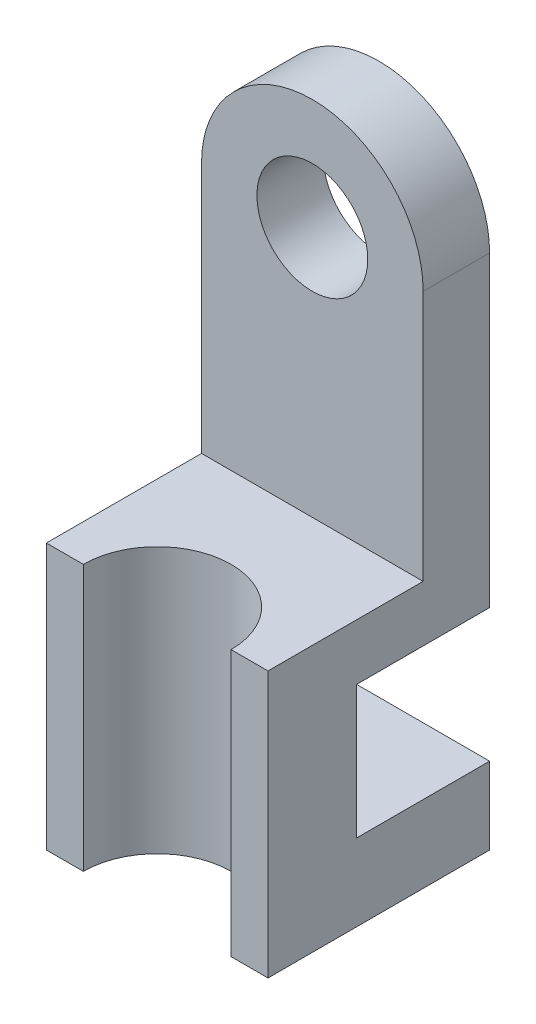
ISO-10303-21;
HEADER;
FILE_DESCRIPTION(('STEP AP214'),'2;1');
FILE_NAME('part.step','',(''),(''),'','','');
FILE_SCHEMA(('AUTOMOTIVE_DESIGN { 1 0 10303 214 1 1 1 1 }'));
ENDSEC;
DATA;
#1=APPLICATION_CONTEXT('core data for automotive mechanical design processes');
#2=APPLICATION_PROTOCOL_DEFINITION('international standard','automotive_design',2000,#1);
#3=PRODUCT_CONTEXT('',#1,'mechanical');
#4=PRODUCT('Part','Part','',(#3));
#5=PRODUCT_RELATED_PRODUCT_CATEGORY('part','',(#4));
#6=PRODUCT_DEFINITION_FORMATION('','',#4);
#7=PRODUCT_DEFINITION_CONTEXT('part definition',#1,'design');
#8=PRODUCT_DEFINITION('design','',#6,#7);
#9=PRODUCT_DEFINITION_SHAPE('','',#8);
#10=(LENGTH_UNIT() NAMED_UNIT(*) SI_UNIT(.MILLI.,.METRE.));
#11=(NAMED_UNIT(*) PLANE_ANGLE_UNIT() SI_UNIT($,.RADIAN.));
#12=(NAMED_UNIT(*) SI_UNIT($,.STERADIAN.) SOLID_ANGLE_UNIT());
#13=UNCERTAINTY_MEASURE_WITH_UNIT(LENGTH_MEASURE(1.E-05),#10,'distance_accuracy_value','');
#14=(GEOMETRIC_REPRESENTATION_CONTEXT(3) GLOBAL_UNCERTAINTY_ASSIGNED_CONTEXT((#13)) GLOBAL_UNIT_ASSIGNED_CONTEXT((#10,
#11,#12)) REPRESENTATION_CONTEXT('',''));
#15=CARTESIAN_POINT('',(0.,0.,0.));
#16=DIRECTION('',(0.,0.,1.));
#17=DIRECTION('',(1.,0.,0.));
#18=AXIS2_PLACEMENT_3D('',#15,#16,#17);
#19=CARTESIAN_POINT('',(0.,70.,-15.));
#20=DIRECTION('',(0.,0.,-1.));
#21=DIRECTION('',(-1.,0.,0.));
#22=AXIS2_PLACEMENT_3D('',#19,#20,#21);
#23=CYLINDRICAL_SURFACE('',#22,15.);
#24=DIRECTION('',(0.,0.,1.));
#25=VECTOR('',#24,1.);
#26=CARTESIAN_POINT('',(15.,70.,-15.));
#27=LINE('',#26,#25);
#28=CARTESIAN_POINT('',(15.,70.,-15.));
#29=VERTEX_POINT('',#28);
#30=CARTESIAN_POINT('',(15.,70.,-6.));
#31=VERTEX_POINT('',#30);
#32=EDGE_CURVE('E127',#29,#31,#27,.T.);
#33=ORIENTED_EDGE('',*,*,#32,.F.);
#34=CARTESIAN_POINT('',(0.,70.,-15.));
#35=DIRECTION('',(0.,0.,1.));
#36=DIRECTION('',(1.,0.,0.));
#37=AXIS2_PLACEMENT_3D('',#34,#35,#36);
#38=CIRCLE('',#37,15.);
#39=CARTESIAN_POINT('',(-15.,70.,-15.));
#40=VERTEX_POINT('',#39);
#41=EDGE_CURVE('E43',#40,#29,#38,.F.);
#42=ORIENTED_EDGE('',*,*,#41,.F.);
#43=DIRECTION('',(0.,0.,1.));
#44=VECTOR('',#43,1.);
#45=CARTESIAN_POINT('',(-15.,70.,-15.));
#46=LINE('',#45,#44);
#47=CARTESIAN_POINT('',(-15.,70.,-6.));
#48=VERTEX_POINT('',#47);
#49=EDGE_CURVE('E218',#48,#40,#46,.F.);
#50=ORIENTED_EDGE('',*,*,#49,.F.);
#51=CARTESIAN_POINT('',(0.,70.,-6.));
#52=DIRECTION('',(0.,0.,-1.));
#53=DIRECTION('',(-1.,0.,0.));
#54=AXIS2_PLACEMENT_3D('',#51,#52,#53);
#55=CIRCLE('',#54,15.);
#56=EDGE_CURVE('E11',#31,#48,#55,.F.);
#57=ORIENTED_EDGE('',*,*,#56,.F.);
#58=EDGE_LOOP('',(#33,#42,#50,#57));
#59=FACE_BOUND('',#58,.T.);
#60=ADVANCED_FACE('F35',(#59),#23,.T.);
#61=CARTESIAN_POINT('',(-15.,36.,15.));
#62=DIRECTION('',(0.,0.,-1.));
#63=DIRECTION('',(-1.,0.,0.));
#64=AXIS2_PLACEMENT_3D('',#61,#62,#63);
#65=PLANE('',#64);
#66=DIRECTION('',(1.,0.,0.));
#67=VECTOR('',#66,1.);
#68=CARTESIAN_POINT('',(-15.,0.,15.));
#69=LINE('',#68,#67);
#70=CARTESIAN_POINT('',(-15.,0.,15.));
#71=VERTEX_POINT('',#70);
#72=CARTESIAN_POINT('',(-10.,0.,15.));
#73=VERTEX_POINT('',#72);
#74=EDGE_CURVE('E141',#71,#73,#69,.T.);
#75=ORIENTED_EDGE('',*,*,#74,.T.);
#76=DIRECTION('',(0.,1.,0.));
#77=VECTOR('',#76,1.);
#78=CARTESIAN_POINT('',(-10.,0.,15.));
#79=LINE('',#78,#77);
#80=CARTESIAN_POINT('',(-10.,36.,15.));
#81=VERTEX_POINT('',#80);
#82=EDGE_CURVE('E161',#73,#81,#79,.T.);
#83=ORIENTED_EDGE('',*,*,#82,.T.);
#84=DIRECTION('',(1.,0.,0.));
#85=VECTOR('',#84,1.);
#86=CARTESIAN_POINT('',(-15.,36.,15.));
#87=LINE('',#86,#85);
#88=CARTESIAN_POINT('',(-15.,36.,15.));
#89=VERTEX_POINT('',#88);
#90=EDGE_CURVE('E193',#89,#81,#87,.T.);
#91=ORIENTED_EDGE('',*,*,#90,.F.);
#92=DIRECTION('',(0.,-1.,0.));
#93=VECTOR('',#92,1.);
#94=CARTESIAN_POINT('',(-15.,36.,15.));
#95=LINE('',#94,#93);
#96=EDGE_CURVE('E208',#89,#71,#95,.T.);
#97=ORIENTED_EDGE('',*,*,#96,.T.);
#98=EDGE_LOOP('',(#75,#83,#91,#97));
#99=FACE_BOUND('',#98,.T.);
#100=ADVANCED_FACE('F235',(#99),#65,.F.);
#101=CARTESIAN_POINT('',(-15.,36.,-15.));
#102=DIRECTION('',(0.,0.,1.));
#103=DIRECTION('',(1.,0.,0.));
#104=AXIS2_PLACEMENT_3D('',#101,#102,#103);
#105=PLANE('',#104);
#106=DIRECTION('',(0.,-1.,0.));
#107=VECTOR('',#106,1.);
#108=CARTESIAN_POINT('',(-15.,36.,-15.));
#109=LINE('',#108,#107);
#110=CARTESIAN_POINT('',(-15.,10.4224192507205,-15.));
#111=VERTEX_POINT('',#110);
#112=CARTESIAN_POINT('',(-15.,0.,-15.));
#113=VERTEX_POINT('',#112);
#114=EDGE_CURVE('E211',#111,#113,#109,.T.);
#115=ORIENTED_EDGE('',*,*,#114,.F.);
#116=DIRECTION('',(1.,0.,0.));
#117=VECTOR('',#116,1.);
#118=CARTESIAN_POINT('',(-15.,10.4224192507205,-15.));
#119=LINE('',#118,#117);
#120=CARTESIAN_POINT('',(15.,10.4224192507205,-15.));
#121=VERTEX_POINT('',#120);
#122=EDGE_CURVE('E182',#111,#121,#119,.T.);
#123=ORIENTED_EDGE('',*,*,#122,.T.);
#124=DIRECTION('',(0.,-1.,0.));
#125=VECTOR('',#124,1.);
#126=CARTESIAN_POINT('',(15.,36.,-15.));
#127=LINE('',#126,#125);
#128=CARTESIAN_POINT('',(15.,0.,-15.));
#129=VERTEX_POINT('',#128);
#130=EDGE_CURVE('E214',#121,#129,#127,.T.);
#131=ORIENTED_EDGE('',*,*,#130,.T.);
#132=DIRECTION('',(-1.,0.,0.));
#133=VECTOR('',#132,1.);
#134=CARTESIAN_POINT('',(-15.,0.,-15.));
#135=LINE('',#134,#133);
#136=EDGE_CURVE('E199',#129,#113,#135,.T.);
#137=ORIENTED_EDGE('',*,*,#136,.T.);
#138=EDGE_LOOP('',(#115,#123,#131,#137));
#139=FACE_BOUND('',#138,.T.);
#140=ADVANCED_FACE('F250',(#139),#105,.F.);
#141=CARTESIAN_POINT('',(15.,36.,-15.));
#142=DIRECTION('',(-1.,0.,0.));
#143=DIRECTION('',(0.,0.,1.));
#144=AXIS2_PLACEMENT_3D('',#141,#142,#143);
#145=PLANE('',#144);
#146=CARTESIAN_POINT('',(15.,28.4224192507205,-15.));
#147=VERTEX_POINT('',#146);
#148=EDGE_CURVE('E215',#29,#147,#127,.T.);
#149=ORIENTED_EDGE('',*,*,#148,.F.);
#150=ORIENTED_EDGE('',*,*,#32,.T.);
#151=DIRECTION('',(0.,-1.,0.));
#152=VECTOR('',#151,1.);
#153=CARTESIAN_POINT('',(15.,85.,-6.));
#154=LINE('',#153,#152);
#155=CARTESIAN_POINT('',(15.,36.,-6.));
#156=VERTEX_POINT('',#155);
#157=EDGE_CURVE('E121',#31,#156,#154,.T.);
#158=ORIENTED_EDGE('',*,*,#157,.T.);
#159=DIRECTION('',(0.,0.,-1.));
#160=VECTOR('',#159,1.);
#161=CARTESIAN_POINT('',(15.,36.,-15.));
#162=LINE('',#161,#160);
#163=CARTESIAN_POINT('',(15.,36.,15.));
#164=VERTEX_POINT('',#163);
#165=EDGE_CURVE('E126',#164,#156,#162,.T.);
#166=ORIENTED_EDGE('',*,*,#165,.F.);
#167=DIRECTION('',(0.,-1.,0.));
#168=VECTOR('',#167,1.);
#169=CARTESIAN_POINT('',(15.,36.,15.));
#170=LINE('',#169,#168);
#171=CARTESIAN_POINT('',(15.,0.,15.));
#172=VERTEX_POINT('',#171);
#173=EDGE_CURVE('E196',#164,#172,#170,.T.);
#174=ORIENTED_EDGE('',*,*,#173,.T.);
#175=DIRECTION('',(0.,0.,-1.));
#176=VECTOR('',#175,1.);
#177=CARTESIAN_POINT('',(15.,0.,-15.));
#178=LINE('',#177,#176);
#179=EDGE_CURVE('E185',#172,#129,#178,.T.);
#180=ORIENTED_EDGE('',*,*,#179,.T.);
#181=ORIENTED_EDGE('',*,*,#130,.F.);
#182=DIRECTION('',(0.,0.,-1.));
#183=VECTOR('',#182,1.);
#184=CARTESIAN_POINT('',(15.,10.4224192507205,-15.));
#185=LINE('',#184,#183);
#186=CARTESIAN_POINT('',(15.,10.4224192507205,3.));
#187=VERTEX_POINT('',#186);
#188=EDGE_CURVE('E169',#187,#121,#185,.T.);
#189=ORIENTED_EDGE('',*,*,#188,.F.);
#190=DIRECTION('',(0.,-1.,0.));
#191=VECTOR('',#190,1.);
#192=CARTESIAN_POINT('',(15.,28.4224192507205,3.));
#193=LINE('',#192,#191);
#194=CARTESIAN_POINT('',(15.,28.4224192507205,3.));
#195=VERTEX_POINT('',#194);
#196=EDGE_CURVE('E178',#195,#187,#193,.T.);
#197=ORIENTED_EDGE('',*,*,#196,.F.);
#198=DIRECTION('',(0.,0.,1.));
#199=VECTOR('',#198,1.);
#200=CARTESIAN_POINT('',(15.,28.4224192507205,-15.));
#201=LINE('',#200,#199);
#202=EDGE_CURVE('E164',#147,#195,#201,.T.);
#203=ORIENTED_EDGE('',*,*,#202,.F.);
#204=EDGE_LOOP('',(#149,#150,#158,#166,#174,#180,#181,#189,#197,#203));
#205=FACE_BOUND('',#204,.T.);
#206=ADVANCED_FACE('F124',(#205),#145,.F.);
#207=CARTESIAN_POINT('',(0.,70.,-15.));
#208=DIRECTION('',(0.,0.,1.));
#209=DIRECTION('',(1.,0.,0.));
#210=AXIS2_PLACEMENT_3D('',#207,#208,#209);
#211=CIRCLE('',#210,7.5);
#212=CARTESIAN_POINT('',(7.5,70.,-15.));
#213=VERTEX_POINT('',#212);
#214=EDGE_CURVE('E145',#213,#213,#211,.T.);
#215=ORIENTED_EDGE('',*,*,#214,.T.);
#216=EDGE_LOOP('',(#215));
#217=FACE_BOUND('',#216,.T.);
#218=CARTESIAN_POINT('',(-15.,28.4224192507205,-15.));
#219=VERTEX_POINT('',#218);
#220=EDGE_CURVE('E212',#40,#219,#109,.T.);
#221=ORIENTED_EDGE('',*,*,#220,.F.);
#222=ORIENTED_EDGE('',*,*,#41,.T.);
#223=ORIENTED_EDGE('',*,*,#148,.T.);
#224=DIRECTION('',(1.,0.,0.));
#225=VECTOR('',#224,1.);
#226=CARTESIAN_POINT('',(-15.,28.4224192507205,-15.));
#227=LINE('',#226,#225);
#228=EDGE_CURVE('E175',#219,#147,#227,.T.);
#229=ORIENTED_EDGE('',*,*,#228,.F.);
#230=EDGE_LOOP('',(#221,#222,#223,#229));
#231=FACE_BOUND('',#230,.T.);
#232=ADVANCED_FACE('F221',(#217,#231),#105,.F.);
#233=CARTESIAN_POINT('',(-15.,36.,-15.));
#234=DIRECTION('',(1.,0.,0.));
#235=DIRECTION('',(0.,0.,-1.));
#236=AXIS2_PLACEMENT_3D('',#233,#234,#235);
#237=PLANE('',#236);
#238=DIRECTION('',(0.,-1.,0.));
#239=VECTOR('',#238,1.);
#240=CARTESIAN_POINT('',(-15.,85.,-6.));
#241=LINE('',#240,#239);
#242=CARTESIAN_POINT('',(-15.,36.,-6.));
#243=VERTEX_POINT('',#242);
#244=EDGE_CURVE('E129',#48,#243,#241,.T.);
#245=ORIENTED_EDGE('',*,*,#244,.F.);
#246=ORIENTED_EDGE('',*,*,#49,.T.);
#247=ORIENTED_EDGE('',*,*,#220,.T.);
#248=DIRECTION('',(0.,0.,1.));
#249=VECTOR('',#248,1.);
#250=CARTESIAN_POINT('',(-15.,28.4224192507205,-15.));
#251=LINE('',#250,#249);
#252=CARTESIAN_POINT('',(-15.,28.4224192507205,3.));
#253=VERTEX_POINT('',#252);
#254=EDGE_CURVE('E165',#219,#253,#251,.T.);
#255=ORIENTED_EDGE('',*,*,#254,.T.);
#256=DIRECTION('',(0.,-1.,0.));
#257=VECTOR('',#256,1.);
#258=CARTESIAN_POINT('',(-15.,28.4224192507205,3.));
#259=LINE('',#258,#257);
#260=CARTESIAN_POINT('',(-15.,10.4224192507205,3.));
#261=VERTEX_POINT('',#260);
#262=EDGE_CURVE('E168',#253,#261,#259,.T.);
#263=ORIENTED_EDGE('',*,*,#262,.T.);
#264=DIRECTION('',(0.,0.,-1.));
#265=VECTOR('',#264,1.);
#266=CARTESIAN_POINT('',(-15.,10.4224192507205,-15.));
#267=LINE('',#266,#265);
#268=EDGE_CURVE('E172',#261,#111,#267,.T.);
#269=ORIENTED_EDGE('',*,*,#268,.T.);
#270=ORIENTED_EDGE('',*,*,#114,.T.);
#271=DIRECTION('',(0.,0.,1.));
#272=VECTOR('',#271,1.);
#273=CARTESIAN_POINT('',(-15.,0.,-15.));
#274=LINE('',#273,#272);
#275=EDGE_CURVE('E202',#113,#71,#274,.T.);
#276=ORIENTED_EDGE('',*,*,#275,.T.);
#277=ORIENTED_EDGE('',*,*,#96,.F.);
#278=DIRECTION('',(0.,0.,1.));
#279=VECTOR('',#278,1.);
#280=CARTESIAN_POINT('',(-15.,36.,-15.));
#281=LINE('',#280,#279);
#282=EDGE_CURVE('E140',#243,#89,#281,.T.);
#283=ORIENTED_EDGE('',*,*,#282,.F.);
#284=EDGE_LOOP('',(#245,#246,#247,#255,#263,#269,#270,#276,#277,#283));
#285=FACE_BOUND('',#284,.T.);
#286=ADVANCED_FACE('F231',(#285),#237,.F.);
#287=CARTESIAN_POINT('',(10.,36.,15.));
#288=VERTEX_POINT('',#287);
#289=EDGE_CURVE('E138',#288,#164,#87,.T.);
#290=ORIENTED_EDGE('',*,*,#289,.F.);
#291=DIRECTION('',(0.,1.,0.));
#292=VECTOR('',#291,1.);
#293=CARTESIAN_POINT('',(10.,0.,15.));
#294=LINE('',#293,#292);
#295=CARTESIAN_POINT('',(10.,0.,15.));
#296=VERTEX_POINT('',#295);
#297=EDGE_CURVE('E157',#288,#296,#294,.F.);
#298=ORIENTED_EDGE('',*,*,#297,.T.);
#299=EDGE_CURVE('E204',#296,#172,#69,.T.);
#300=ORIENTED_EDGE('',*,*,#299,.T.);
#301=ORIENTED_EDGE('',*,*,#173,.F.);
#302=EDGE_LOOP('',(#290,#298,#300,#301));
#303=FACE_BOUND('',#302,.T.);
#304=ADVANCED_FACE('F246',(#303),#65,.F.);
#305=CARTESIAN_POINT('',(0.,36.,0.));
#306=DIRECTION('',(0.,1.,0.));
#307=DIRECTION('',(0.,0.,1.));
#308=AXIS2_PLACEMENT_3D('',#305,#306,#307);
#309=PLANE('',#308);
#310=DIRECTION('',(1.,0.,0.));
#311=VECTOR('',#310,1.);
#312=CARTESIAN_POINT('',(-15.,36.,-6.));
#313=LINE('',#312,#311);
#314=EDGE_CURVE('E130',#243,#156,#313,.T.);
#315=ORIENTED_EDGE('',*,*,#314,.F.);
#316=ORIENTED_EDGE('',*,*,#282,.T.);
#317=ORIENTED_EDGE('',*,*,#90,.T.);
#318=CARTESIAN_POINT('',(0.,36.,15.));
#319=DIRECTION('',(0.,1.,0.));
#320=DIRECTION('',(0.,0.,1.));
#321=AXIS2_PLACEMENT_3D('',#318,#319,#320);
#322=CIRCLE('',#321,10.);
#323=EDGE_CURVE('E153',#288,#81,#322,.T.);
#324=ORIENTED_EDGE('',*,*,#323,.F.);
#325=ORIENTED_EDGE('',*,*,#289,.T.);
#326=ORIENTED_EDGE('',*,*,#165,.T.);
#327=EDGE_LOOP('',(#315,#316,#317,#324,#325,#326));
#328=FACE_BOUND('',#327,.T.);
#329=ADVANCED_FACE('F134',(#328),#309,.T.);
#330=CARTESIAN_POINT('',(0.,0.,0.));
#331=DIRECTION('',(0.,1.,0.));
#332=DIRECTION('',(0.,0.,1.));
#333=AXIS2_PLACEMENT_3D('',#330,#331,#332);
#334=PLANE('',#333);
#335=ORIENTED_EDGE('',*,*,#299,.F.);
#336=CARTESIAN_POINT('',(0.,0.,15.));
#337=DIRECTION('',(0.,1.,0.));
#338=DIRECTION('',(0.,0.,1.));
#339=AXIS2_PLACEMENT_3D('',#336,#337,#338);
#340=CIRCLE('',#339,10.);
#341=EDGE_CURVE('E154',#296,#73,#340,.T.);
#342=ORIENTED_EDGE('',*,*,#341,.T.);
#343=ORIENTED_EDGE('',*,*,#74,.F.);
#344=ORIENTED_EDGE('',*,*,#275,.F.);
#345=ORIENTED_EDGE('',*,*,#136,.F.);
#346=ORIENTED_EDGE('',*,*,#179,.F.);
#347=EDGE_LOOP('',(#335,#342,#343,#344,#345,#346));
#348=FACE_BOUND('',#347,.T.);
#349=ADVANCED_FACE('F241',(#348),#334,.F.);
#350=CARTESIAN_POINT('',(-15.,10.4224192507205,-15.));
#351=DIRECTION('',(0.,-1.,0.));
#352=DIRECTION('',(0.,0.,-1.));
#353=AXIS2_PLACEMENT_3D('',#350,#351,#352);
#354=PLANE('',#353);
#355=ORIENTED_EDGE('',*,*,#188,.T.);
#356=ORIENTED_EDGE('',*,*,#122,.F.);
#357=ORIENTED_EDGE('',*,*,#268,.F.);
#358=DIRECTION('',(1.,0.,0.));
#359=VECTOR('',#358,1.);
#360=CARTESIAN_POINT('',(-15.,10.4224192507205,3.));
#361=LINE('',#360,#359);
#362=EDGE_CURVE('E186',#261,#187,#361,.T.);
#363=ORIENTED_EDGE('',*,*,#362,.T.);
#364=EDGE_LOOP('',(#355,#356,#357,#363));
#365=FACE_BOUND('',#364,.T.);
#366=ADVANCED_FACE('F253',(#365),#354,.F.);
#367=CARTESIAN_POINT('',(-15.,28.4224192507205,3.));
#368=DIRECTION('',(0.,0.,1.));
#369=DIRECTION('',(1.,0.,0.));
#370=AXIS2_PLACEMENT_3D('',#367,#368,#369);
#371=PLANE('',#370);
#372=ORIENTED_EDGE('',*,*,#196,.T.);
#373=ORIENTED_EDGE('',*,*,#362,.F.);
#374=ORIENTED_EDGE('',*,*,#262,.F.);
#375=DIRECTION('',(1.,0.,0.));
#376=VECTOR('',#375,1.);
#377=CARTESIAN_POINT('',(-15.,28.4224192507205,3.));
#378=LINE('',#377,#376);
#379=EDGE_CURVE('E188',#253,#195,#378,.T.);
#380=ORIENTED_EDGE('',*,*,#379,.T.);
#381=EDGE_LOOP('',(#372,#373,#374,#380));
#382=FACE_BOUND('',#381,.T.);
#383=ADVANCED_FACE('F255',(#382),#371,.F.);
#384=CARTESIAN_POINT('',(-15.,28.4224192507205,-15.));
#385=DIRECTION('',(0.,1.,0.));
#386=DIRECTION('',(0.,0.,1.));
#387=AXIS2_PLACEMENT_3D('',#384,#385,#386);
#388=PLANE('',#387);
#389=ORIENTED_EDGE('',*,*,#202,.T.);
#390=ORIENTED_EDGE('',*,*,#379,.F.);
#391=ORIENTED_EDGE('',*,*,#254,.F.);
#392=ORIENTED_EDGE('',*,*,#228,.T.);
#393=EDGE_LOOP('',(#389,#390,#391,#392));
#394=FACE_BOUND('',#393,.T.);
#395=ADVANCED_FACE('F228',(#394),#388,.F.);
#396=CARTESIAN_POINT('',(0.,0.,15.));
#397=DIRECTION('',(0.,1.,0.));
#398=DIRECTION('',(0.,0.,1.));
#399=AXIS2_PLACEMENT_3D('',#396,#397,#398);
#400=CYLINDRICAL_SURFACE('',#399,10.);
#401=ORIENTED_EDGE('',*,*,#341,.F.);
#402=ORIENTED_EDGE('',*,*,#297,.F.);
#403=ORIENTED_EDGE('',*,*,#323,.T.);
#404=ORIENTED_EDGE('',*,*,#82,.F.);
#405=EDGE_LOOP('',(#401,#402,#403,#404));
#406=FACE_BOUND('',#405,.T.);
#407=ADVANCED_FACE('F238',(#406),#400,.F.);
#408=CARTESIAN_POINT('',(-15.,85.,-6.));
#409=DIRECTION('',(0.,0.,-1.));
#410=DIRECTION('',(-1.,0.,0.));
#411=AXIS2_PLACEMENT_3D('',#408,#409,#410);
#412=PLANE('',#411);
#413=CARTESIAN_POINT('',(0.,70.,-6.));
#414=DIRECTION('',(0.,0.,1.));
#415=DIRECTION('',(1.,0.,0.));
#416=AXIS2_PLACEMENT_3D('',#413,#414,#415);
#417=CIRCLE('',#416,7.5);
#418=CARTESIAN_POINT('',(7.5,70.,-6.));
#419=VERTEX_POINT('',#418);
#420=EDGE_CURVE('E148',#419,#419,#417,.T.);
#421=ORIENTED_EDGE('',*,*,#420,.F.);
#422=EDGE_LOOP('',(#421));
#423=FACE_BOUND('',#422,.T.);
#424=ORIENTED_EDGE('',*,*,#157,.F.);
#425=ORIENTED_EDGE('',*,*,#56,.T.);
#426=ORIENTED_EDGE('',*,*,#244,.T.);
#427=ORIENTED_EDGE('',*,*,#314,.T.);
#428=EDGE_LOOP('',(#424,#425,#426,#427));
#429=FACE_BOUND('',#428,.T.);
#430=ADVANCED_FACE('F143',(#423,#429),#412,.F.);
#431=CARTESIAN_POINT('',(0.,70.,-15.));
#432=DIRECTION('',(0.,0.,1.));
#433=DIRECTION('',(1.,0.,0.));
#434=AXIS2_PLACEMENT_3D('',#431,#432,#433);
#435=CYLINDRICAL_SURFACE('',#434,7.5);
#436=ORIENTED_EDGE('',*,*,#214,.F.);
#437=EDGE_LOOP('',(#436));
#438=FACE_BOUND('',#437,.T.);
#439=ORIENTED_EDGE('',*,*,#420,.T.);
#440=EDGE_LOOP('',(#439));
#441=FACE_BOUND('',#440,.T.);
#442=ADVANCED_FACE('F306',(#438,#441),#435,.F.);
#443=CLOSED_SHELL('',(#60,#100,#140,#206,#232,#286,#304,#329,#349,#366,#383,#395,#407,#430,#442));
#444=MANIFOLD_SOLID_BREP('B2',#443);
#445=ADVANCED_BREP_SHAPE_REPRESENTATION('',(#18,#444),#14);
#446=SHAPE_DEFINITION_REPRESENTATION(#9,#445);
ENDSEC;
END-ISO-10303-21;
